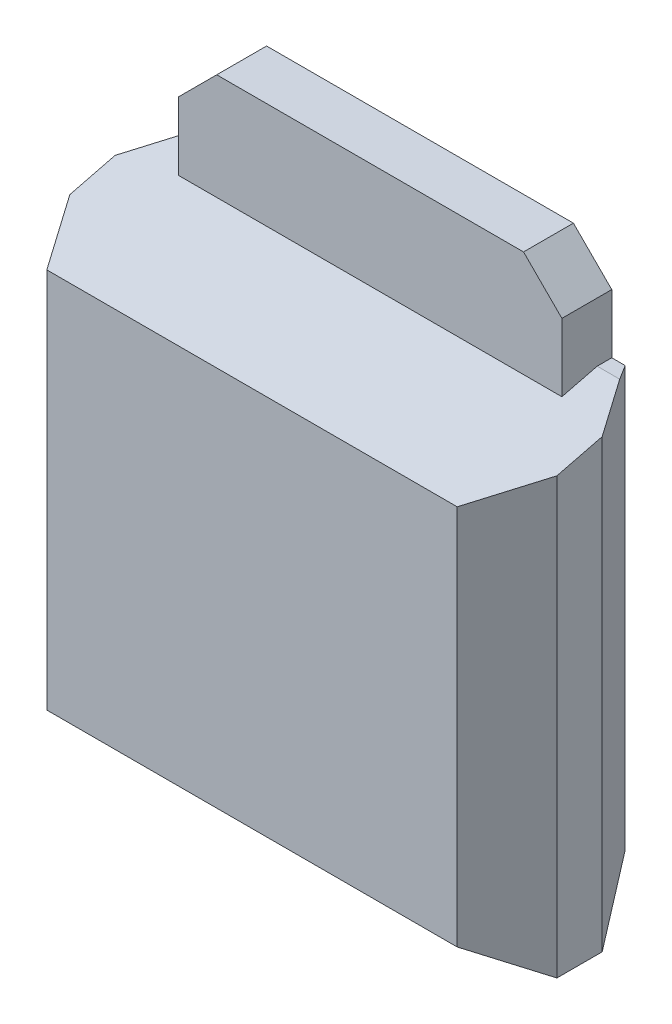
ISO-10303-21;
HEADER;
FILE_DESCRIPTION(('STEP AP214'),'2;1');
FILE_NAME('part.step','',(''),(''),'','','');
FILE_SCHEMA(('AUTOMOTIVE_DESIGN { 1 0 10303 214 1 1 1 1 }'));
ENDSEC;
DATA;
#1=APPLICATION_CONTEXT('core data for automotive mechanical design processes');
#2=APPLICATION_PROTOCOL_DEFINITION('international standard','automotive_design',2000,#1);
#3=PRODUCT_CONTEXT('',#1,'mechanical');
#4=PRODUCT('Part','Part','',(#3));
#5=PRODUCT_RELATED_PRODUCT_CATEGORY('part','',(#4));
#6=PRODUCT_DEFINITION_FORMATION('','',#4);
#7=PRODUCT_DEFINITION_CONTEXT('part definition',#1,'design');
#8=PRODUCT_DEFINITION('design','',#6,#7);
#9=PRODUCT_DEFINITION_SHAPE('','',#8);
#10=(LENGTH_UNIT() NAMED_UNIT(*) SI_UNIT(.MILLI.,.METRE.));
#11=(NAMED_UNIT(*) PLANE_ANGLE_UNIT() SI_UNIT($,.RADIAN.));
#12=(NAMED_UNIT(*) SI_UNIT($,.STERADIAN.) SOLID_ANGLE_UNIT());
#13=UNCERTAINTY_MEASURE_WITH_UNIT(LENGTH_MEASURE(1.E-05),#10,'distance_accuracy_value','');
#14=(GEOMETRIC_REPRESENTATION_CONTEXT(3) GLOBAL_UNCERTAINTY_ASSIGNED_CONTEXT((#13)) GLOBAL_UNIT_ASSIGNED_CONTEXT((#10,
#11,#12)) REPRESENTATION_CONTEXT('',''));
#15=CARTESIAN_POINT('',(0.,0.,0.));
#16=DIRECTION('',(0.,0.,1.));
#17=DIRECTION('',(1.,0.,0.));
#18=AXIS2_PLACEMENT_3D('',#15,#16,#17);
#19=CARTESIAN_POINT('',(0.,5.97,2.19));
#20=DIRECTION('',(0.,-1.,0.));
#21=DIRECTION('',(1.,0.,0.));
#22=AXIS2_PLACEMENT_3D('',#19,#20,#21);
#23=PLANE('',#22);
#24=DIRECTION('',(-1.,0.,0.));
#25=VECTOR('',#24,1.);
#26=CARTESIAN_POINT('',(0.,5.97,0.));
#27=LINE('',#26,#25);
#28=CARTESIAN_POINT('',(5.85,5.97,0.));
#29=VERTEX_POINT('',#28);
#30=CARTESIAN_POINT('',(5.675,5.97,0.));
#31=VERTEX_POINT('',#30);
#32=EDGE_CURVE('E178',#29,#31,#27,.T.);
#33=ORIENTED_EDGE('',*,*,#32,.T.);
#34=DIRECTION('',(0.,0.,1.));
#35=VECTOR('',#34,1.);
#36=CARTESIAN_POINT('',(5.675,5.97,2.19));
#37=LINE('',#36,#35);
#38=CARTESIAN_POINT('',(5.675,5.97,0.189999999999976));
#39=VERTEX_POINT('',#38);
#40=EDGE_CURVE('E175',#31,#39,#37,.T.);
#41=ORIENTED_EDGE('',*,*,#40,.T.);
#42=DIRECTION('',(1.,0.,0.));
#43=VECTOR('',#42,1.);
#44=CARTESIAN_POINT('',(0.,5.97,0.189999999999976));
#45=LINE('',#44,#43);
#46=CARTESIAN_POINT('',(5.96874999999998,5.97,0.189999999999973));
#47=VERTEX_POINT('',#46);
#48=EDGE_CURVE('E241',#39,#47,#45,.T.);
#49=ORIENTED_EDGE('',*,*,#48,.T.);
#50=DIRECTION('',(-0.52999894000318,0.,-0.847998304005088));
#51=VECTOR('',#50,1.);
#52=CARTESIAN_POINT('',(6.35,5.97,0.800000000000004));
#53=LINE('',#52,#51);
#54=EDGE_CURVE('E194',#47,#29,#53,.T.);
#55=ORIENTED_EDGE('',*,*,#54,.T.);
#56=EDGE_LOOP('',(#33,#41,#49,#55));
#57=FACE_BOUND('',#56,.T.);
#58=ADVANCED_FACE('F30',(#57),#23,.F.);
#59=CARTESIAN_POINT('',(0.,0.,2.19));
#60=DIRECTION('',(1.,0.,0.));
#61=DIRECTION('',(0.,0.,-1.));
#62=AXIS2_PLACEMENT_3D('',#59,#60,#61);
#63=PLANE('',#62);
#64=DIRECTION('',(0.,1.,0.));
#65=VECTOR('',#64,1.);
#66=CARTESIAN_POINT('',(0.,0.,1.39));
#67=LINE('',#66,#65);
#68=CARTESIAN_POINT('',(0.,0.,1.39));
#69=VERTEX_POINT('',#68);
#70=CARTESIAN_POINT('',(0.,5.67,1.39));
#71=VERTEX_POINT('',#70);
#72=EDGE_CURVE('E219',#69,#71,#67,.T.);
#73=ORIENTED_EDGE('',*,*,#72,.T.);
#74=DIRECTION('',(0.,-0.24253562503633,0.970142500145333));
#75=VECTOR('',#74,1.);
#76=CARTESIAN_POINT('',(0.,5.47,2.19));
#77=LINE('',#76,#75);
#78=CARTESIAN_POINT('',(0.,5.81749999999999,0.800000000000006));
#79=VERTEX_POINT('',#78);
#80=EDGE_CURVE('E237',#71,#79,#77,.F.);
#81=ORIENTED_EDGE('',*,*,#80,.T.);
#82=DIRECTION('',(0.,-1.,0.));
#83=VECTOR('',#82,1.);
#84=CARTESIAN_POINT('',(0.,0.500000000000002,0.800000000000006));
#85=LINE('',#84,#83);
#86=CARTESIAN_POINT('',(0.,0.,0.800000000000006));
#87=VERTEX_POINT('',#86);
#88=EDGE_CURVE('E222',#79,#87,#85,.T.);
#89=ORIENTED_EDGE('',*,*,#88,.T.);
#90=DIRECTION('',(0.,0.,-1.));
#91=VECTOR('',#90,1.);
#92=CARTESIAN_POINT('',(0.,0.,2.19));
#93=LINE('',#92,#91);
#94=EDGE_CURVE('E183',#69,#87,#93,.T.);
#95=ORIENTED_EDGE('',*,*,#94,.F.);
#96=EDGE_LOOP('',(#73,#81,#89,#95));
#97=FACE_BOUND('',#96,.T.);
#98=ADVANCED_FACE('F295',(#97),#63,.F.);
#99=CARTESIAN_POINT('',(0.,0.,2.19));
#100=DIRECTION('',(0.,1.,0.));
#101=DIRECTION('',(0.,0.,1.));
#102=AXIS2_PLACEMENT_3D('',#99,#100,#101);
#103=PLANE('',#102);
#104=ORIENTED_EDGE('',*,*,#94,.T.);
#105=DIRECTION('',(1.,0.,0.));
#106=VECTOR('',#105,1.);
#107=CARTESIAN_POINT('',(5.85,0.,0.800000000000006));
#108=LINE('',#107,#106);
#109=CARTESIAN_POINT('',(6.35,0.,0.800000000000003));
#110=VERTEX_POINT('',#109);
#111=EDGE_CURVE('E207',#87,#110,#108,.T.);
#112=ORIENTED_EDGE('',*,*,#111,.T.);
#113=DIRECTION('',(0.,0.,-1.));
#114=VECTOR('',#113,1.);
#115=CARTESIAN_POINT('',(6.35,0.,2.19));
#116=LINE('',#115,#114);
#117=CARTESIAN_POINT('',(6.35,0.,1.39));
#118=VERTEX_POINT('',#117);
#119=EDGE_CURVE('E180',#118,#110,#116,.T.);
#120=ORIENTED_EDGE('',*,*,#119,.F.);
#121=DIRECTION('',(-1.,0.,0.));
#122=VECTOR('',#121,1.);
#123=CARTESIAN_POINT('',(0.,0.,1.39));
#124=LINE('',#123,#122);
#125=EDGE_CURVE('E204',#118,#69,#124,.T.);
#126=ORIENTED_EDGE('',*,*,#125,.T.);
#127=EDGE_LOOP('',(#104,#112,#120,#126));
#128=FACE_BOUND('',#127,.T.);
#129=ADVANCED_FACE('F327',(#128),#103,.F.);
#130=CARTESIAN_POINT('',(6.35,0.,2.19));
#131=DIRECTION('',(-1.,0.,0.));
#132=DIRECTION('',(0.,0.,1.));
#133=AXIS2_PLACEMENT_3D('',#130,#131,#132);
#134=PLANE('',#133);
#135=DIRECTION('',(0.,1.,0.));
#136=VECTOR('',#135,1.);
#137=CARTESIAN_POINT('',(6.35,5.97,0.800000000000003));
#138=LINE('',#137,#136);
#139=CARTESIAN_POINT('',(6.35,5.81749999999999,0.800000000000003));
#140=VERTEX_POINT('',#139);
#141=EDGE_CURVE('E191',#110,#140,#138,.T.);
#142=ORIENTED_EDGE('',*,*,#141,.T.);
#143=DIRECTION('',(0.,0.24253562503633,-0.970142500145333));
#144=VECTOR('',#143,1.);
#145=CARTESIAN_POINT('',(6.35,5.47,2.19));
#146=LINE('',#145,#144);
#147=CARTESIAN_POINT('',(6.35,5.67,1.39));
#148=VERTEX_POINT('',#147);
#149=EDGE_CURVE('E246',#140,#148,#146,.F.);
#150=ORIENTED_EDGE('',*,*,#149,.T.);
#151=DIRECTION('',(0.,-1.,0.));
#152=VECTOR('',#151,1.);
#153=CARTESIAN_POINT('',(6.35,0.,1.39));
#154=LINE('',#153,#152);
#155=EDGE_CURVE('E189',#148,#118,#154,.T.);
#156=ORIENTED_EDGE('',*,*,#155,.T.);
#157=ORIENTED_EDGE('',*,*,#119,.T.);
#158=EDGE_LOOP('',(#142,#150,#156,#157));
#159=FACE_BOUND('',#158,.T.);
#160=ADVANCED_FACE('F315',(#159),#134,.F.);
#161=CARTESIAN_POINT('',(0.381250000000018,5.97,0.189999999999976));
#162=VERTEX_POINT('',#161);
#163=CARTESIAN_POINT('',(0.675,5.97,0.189999999999976));
#164=VERTEX_POINT('',#163);
#165=EDGE_CURVE('E242',#162,#164,#45,.T.);
#166=ORIENTED_EDGE('',*,*,#165,.T.);
#167=DIRECTION('',(0.,0.,-1.));
#168=VECTOR('',#167,1.);
#169=CARTESIAN_POINT('',(0.675,5.97,2.19));
#170=LINE('',#169,#168);
#171=CARTESIAN_POINT('',(0.674999999999999,5.97,0.));
#172=VERTEX_POINT('',#171);
#173=EDGE_CURVE('E160',#164,#172,#170,.T.);
#174=ORIENTED_EDGE('',*,*,#173,.T.);
#175=CARTESIAN_POINT('',(0.500000000000002,5.97,0.));
#176=VERTEX_POINT('',#175);
#177=EDGE_CURVE('E177',#172,#176,#27,.T.);
#178=ORIENTED_EDGE('',*,*,#177,.T.);
#179=DIRECTION('',(-0.529998940003179,0.,0.847998304005089));
#180=VECTOR('',#179,1.);
#181=CARTESIAN_POINT('',(0.,5.97,0.800000000000005));
#182=LINE('',#181,#180);
#183=EDGE_CURVE('E229',#176,#162,#182,.T.);
#184=ORIENTED_EDGE('',*,*,#183,.T.);
#185=EDGE_LOOP('',(#166,#174,#178,#184));
#186=FACE_BOUND('',#185,.T.);
#187=ADVANCED_FACE('F286',(#186),#23,.F.);
#188=CARTESIAN_POINT('',(0.,5.97,2.19));
#189=DIRECTION('',(0.,0.,-1.));
#190=DIRECTION('',(-1.,0.,0.));
#191=AXIS2_PLACEMENT_3D('',#188,#189,#190);
#192=PLANE('',#191);
#193=DIRECTION('',(0.,1.,0.));
#194=VECTOR('',#193,1.);
#195=CARTESIAN_POINT('',(5.85,5.97,2.19));
#196=LINE('',#195,#194);
#197=CARTESIAN_POINT('',(5.85,0.5,2.19));
#198=VERTEX_POINT('',#197);
#199=CARTESIAN_POINT('',(5.85,5.47,2.19));
#200=VERTEX_POINT('',#199);
#201=EDGE_CURVE('E186',#198,#200,#196,.T.);
#202=ORIENTED_EDGE('',*,*,#201,.T.);
#203=DIRECTION('',(-1.,0.,0.));
#204=VECTOR('',#203,1.);
#205=CARTESIAN_POINT('',(0.,5.47,2.19));
#206=LINE('',#205,#204);
#207=CARTESIAN_POINT('',(0.5,5.47,2.19));
#208=VERTEX_POINT('',#207);
#209=EDGE_CURVE('E232',#200,#208,#206,.T.);
#210=ORIENTED_EDGE('',*,*,#209,.T.);
#211=DIRECTION('',(0.,-1.,0.));
#212=VECTOR('',#211,1.);
#213=CARTESIAN_POINT('',(0.5,5.97,2.19));
#214=LINE('',#213,#212);
#215=CARTESIAN_POINT('',(0.5,0.5,2.19));
#216=VERTEX_POINT('',#215);
#217=EDGE_CURVE('E215',#208,#216,#214,.T.);
#218=ORIENTED_EDGE('',*,*,#217,.T.);
#219=DIRECTION('',(1.,0.,0.));
#220=VECTOR('',#219,1.);
#221=CARTESIAN_POINT('',(0.,0.5,2.19));
#222=LINE('',#221,#220);
#223=EDGE_CURVE('E199',#216,#198,#222,.T.);
#224=ORIENTED_EDGE('',*,*,#223,.T.);
#225=EDGE_LOOP('',(#202,#210,#218,#224));
#226=FACE_BOUND('',#225,.T.);
#227=ADVANCED_FACE('F305',(#226),#192,.F.);
#228=CARTESIAN_POINT('',(0.,5.97,0.));
#229=DIRECTION('',(0.,0.,-1.));
#230=DIRECTION('',(-1.,0.,0.));
#231=AXIS2_PLACEMENT_3D('',#228,#229,#230);
#232=PLANE('',#231);
#233=DIRECTION('',(-1.,0.,0.));
#234=VECTOR('',#233,1.);
#235=CARTESIAN_POINT('',(0.675,7.24,0.));
#236=LINE('',#235,#234);
#237=CARTESIAN_POINT('',(5.175,7.24,0.));
#238=VERTEX_POINT('',#237);
#239=CARTESIAN_POINT('',(1.175,7.24,0.));
#240=VERTEX_POINT('',#239);
#241=EDGE_CURVE('E270',#238,#240,#236,.T.);
#242=ORIENTED_EDGE('',*,*,#241,.F.);
#243=DIRECTION('',(0.707106781186547,-0.707106781186548,0.));
#244=VECTOR('',#243,1.);
#245=CARTESIAN_POINT('',(3.2225,9.1925,0.));
#246=LINE('',#245,#244);
#247=CARTESIAN_POINT('',(5.675,6.74,0.));
#248=VERTEX_POINT('',#247);
#249=EDGE_CURVE('E258',#238,#248,#246,.T.);
#250=ORIENTED_EDGE('',*,*,#249,.T.);
#251=DIRECTION('',(0.,1.,0.));
#252=VECTOR('',#251,1.);
#253=CARTESIAN_POINT('',(5.675,0.969999999999998,0.));
#254=LINE('',#253,#252);
#255=EDGE_CURVE('E167',#31,#248,#254,.T.);
#256=ORIENTED_EDGE('',*,*,#255,.F.);
#257=ORIENTED_EDGE('',*,*,#32,.F.);
#258=DIRECTION('',(0.,-1.,0.));
#259=VECTOR('',#258,1.);
#260=CARTESIAN_POINT('',(5.85,0.,0.));
#261=LINE('',#260,#259);
#262=CARTESIAN_POINT('',(5.85,0.500000000000002,0.));
#263=VERTEX_POINT('',#262);
#264=EDGE_CURVE('E196',#29,#263,#261,.T.);
#265=ORIENTED_EDGE('',*,*,#264,.T.);
#266=DIRECTION('',(-1.,0.,0.));
#267=VECTOR('',#266,1.);
#268=CARTESIAN_POINT('',(0.,0.500000000000002,0.));
#269=LINE('',#268,#267);
#270=CARTESIAN_POINT('',(0.500000000000002,0.500000000000002,0.));
#271=VERTEX_POINT('',#270);
#272=EDGE_CURVE('E212',#263,#271,#269,.T.);
#273=ORIENTED_EDGE('',*,*,#272,.T.);
#274=DIRECTION('',(0.,1.,0.));
#275=VECTOR('',#274,1.);
#276=CARTESIAN_POINT('',(0.500000000000002,5.97,0.));
#277=LINE('',#276,#275);
#278=EDGE_CURVE('E226',#271,#176,#277,.T.);
#279=ORIENTED_EDGE('',*,*,#278,.T.);
#280=ORIENTED_EDGE('',*,*,#177,.F.);
#281=DIRECTION('',(0.,1.,0.));
#282=VECTOR('',#281,1.);
#283=CARTESIAN_POINT('',(0.674999999999999,0.97,0.));
#284=LINE('',#283,#282);
#285=CARTESIAN_POINT('',(0.675,6.74,0.));
#286=VERTEX_POINT('',#285);
#287=EDGE_CURVE('E165',#172,#286,#284,.T.);
#288=ORIENTED_EDGE('',*,*,#287,.T.);
#289=DIRECTION('',(0.707106781186546,0.707106781186549,0.));
#290=VECTOR('',#289,1.);
#291=CARTESIAN_POINT('',(-0.0474999999999982,6.0175,0.));
#292=LINE('',#291,#290);
#293=EDGE_CURVE('E256',#286,#240,#292,.T.);
#294=ORIENTED_EDGE('',*,*,#293,.T.);
#295=EDGE_LOOP('',(#242,#250,#256,#257,#265,#273,#279,#280,#288,#294));
#296=FACE_BOUND('',#295,.T.);
#297=ADVANCED_FACE('F275',(#296),#232,.T.);
#298=CARTESIAN_POINT('',(5.85,5.97,2.19));
#299=DIRECTION('',(-0.847998304005088,0.,-0.529998940003179));
#300=DIRECTION('',(-0.529998940003179,0.,0.847998304005088));
#301=AXIS2_PLACEMENT_3D('',#298,#299,#300);
#302=PLANE('',#301);
#303=ORIENTED_EDGE('',*,*,#155,.F.);
#304=DIRECTION('',(-0.518475847365212,-0.207390338946082,0.829561355784341));
#305=VECTOR('',#304,1.);
#306=CARTESIAN_POINT('',(5.90376344086021,5.49150537634408,2.10397849462366));
#307=LINE('',#306,#305);
#308=EDGE_CURVE('E161',#148,#200,#307,.T.);
#309=ORIENTED_EDGE('',*,*,#308,.T.);
#310=ORIENTED_EDGE('',*,*,#201,.F.);
#311=DIRECTION('',(0.468292905790847,-0.468292905790846,-0.749268649265356));
#312=VECTOR('',#311,1.);
#313=CARTESIAN_POINT('',(4.65043859649123,1.69956140350877,4.10929824561403));
#314=LINE('',#313,#312);
#315=EDGE_CURVE('E201',#198,#118,#314,.T.);
#316=ORIENTED_EDGE('',*,*,#315,.T.);
#317=EDGE_LOOP('',(#303,#309,#310,#316));
#318=FACE_BOUND('',#317,.T.);
#319=ADVANCED_FACE('F310',(#318),#302,.F.);
#320=CARTESIAN_POINT('',(6.35,0.,0.800000000000003));
#321=DIRECTION('',(0.847998304005088,0.,-0.52999894000318));
#322=DIRECTION('',(-0.52999894000318,0.,-0.847998304005088));
#323=AXIS2_PLACEMENT_3D('',#320,#321,#322);
#324=PLANE('',#323);
#325=ORIENTED_EDGE('',*,*,#54,.F.);
#326=DIRECTION('',(-0.518475847365213,0.207390338946083,-0.829561355784341));
#327=VECTOR('',#326,1.);
#328=CARTESIAN_POINT('',(6.97553763440859,5.56728494623656,1.80086021505375));
#329=LINE('',#328,#327);
#330=EDGE_CURVE('E244',#47,#140,#329,.F.);
#331=ORIENTED_EDGE('',*,*,#330,.T.);
#332=ORIENTED_EDGE('',*,*,#141,.F.);
#333=DIRECTION('',(-0.468292905790847,0.468292905790846,-0.749268649265356));
#334=VECTOR('',#333,1.);
#335=CARTESIAN_POINT('',(6.35,0.,0.800000000000003));
#336=LINE('',#335,#334);
#337=EDGE_CURVE('E210',#110,#263,#336,.T.);
#338=ORIENTED_EDGE('',*,*,#337,.T.);
#339=ORIENTED_EDGE('',*,*,#264,.F.);
#340=EDGE_LOOP('',(#325,#331,#332,#338,#339));
#341=FACE_BOUND('',#340,.T.);
#342=ADVANCED_FACE('F319',(#341),#324,.T.);
#343=CARTESIAN_POINT('',(0.,0.5,2.19));
#344=DIRECTION('',(0.,0.847998304005089,-0.529998940003178));
#345=DIRECTION('',(0.,0.529998940003178,0.847998304005089));
#346=AXIS2_PLACEMENT_3D('',#343,#344,#345);
#347=PLANE('',#346);
#348=ORIENTED_EDGE('',*,*,#223,.F.);
#349=DIRECTION('',(-0.468292905790846,-0.468292905790846,-0.749268649265356));
#350=VECTOR('',#349,1.);
#351=CARTESIAN_POINT('',(0.390350877192983,0.390350877192983,2.01456140350877));
#352=LINE('',#351,#350);
#353=EDGE_CURVE('E217',#216,#69,#352,.T.);
#354=ORIENTED_EDGE('',*,*,#353,.T.);
#355=ORIENTED_EDGE('',*,*,#125,.F.);
#356=ORIENTED_EDGE('',*,*,#315,.F.);
#357=EDGE_LOOP('',(#348,#354,#355,#356));
#358=FACE_BOUND('',#357,.T.);
#359=ADVANCED_FACE('F330',(#358),#347,.F.);
#360=CARTESIAN_POINT('',(0.,0.,0.800000000000006));
#361=DIRECTION('',(0.,-0.847998304005089,-0.529998940003179));
#362=DIRECTION('',(0.,0.529998940003179,-0.847998304005089));
#363=AXIS2_PLACEMENT_3D('',#360,#361,#362);
#364=PLANE('',#363);
#365=ORIENTED_EDGE('',*,*,#111,.F.);
#366=DIRECTION('',(0.468292905790846,0.468292905790846,-0.749268649265356));
#367=VECTOR('',#366,1.);
#368=CARTESIAN_POINT('',(0.,0.,0.800000000000006));
#369=LINE('',#368,#367);
#370=EDGE_CURVE('E224',#87,#271,#369,.T.);
#371=ORIENTED_EDGE('',*,*,#370,.T.);
#372=ORIENTED_EDGE('',*,*,#272,.F.);
#373=ORIENTED_EDGE('',*,*,#337,.F.);
#374=EDGE_LOOP('',(#365,#371,#372,#373));
#375=FACE_BOUND('',#374,.T.);
#376=ADVANCED_FACE('F325',(#375),#364,.T.);
#377=CARTESIAN_POINT('',(0.5,5.97,2.19));
#378=DIRECTION('',(0.847998304005089,0.,-0.529998940003178));
#379=DIRECTION('',(-0.529998940003178,0.,-0.847998304005089));
#380=AXIS2_PLACEMENT_3D('',#377,#378,#379);
#381=PLANE('',#380);
#382=ORIENTED_EDGE('',*,*,#217,.F.);
#383=DIRECTION('',(-0.518475847365211,0.207390338946083,-0.829561355784342));
#384=VECTOR('',#383,1.);
#385=CARTESIAN_POINT('',(0.446236559139786,5.49150537634409,2.10397849462366));
#386=LINE('',#385,#384);
#387=EDGE_CURVE('E235',#208,#71,#386,.T.);
#388=ORIENTED_EDGE('',*,*,#387,.T.);
#389=ORIENTED_EDGE('',*,*,#72,.F.);
#390=ORIENTED_EDGE('',*,*,#353,.F.);
#391=EDGE_LOOP('',(#382,#388,#389,#390));
#392=FACE_BOUND('',#391,.T.);
#393=ADVANCED_FACE('F300',(#392),#381,.F.);
#394=CARTESIAN_POINT('',(0.,0.,0.800000000000006));
#395=DIRECTION('',(-0.847998304005089,0.,-0.529998940003179));
#396=DIRECTION('',(-0.529998940003179,0.,0.847998304005089));
#397=AXIS2_PLACEMENT_3D('',#394,#395,#396);
#398=PLANE('',#397);
#399=ORIENTED_EDGE('',*,*,#88,.F.);
#400=DIRECTION('',(-0.518475847365212,-0.207390338946082,0.829561355784341));
#401=VECTOR('',#400,1.);
#402=CARTESIAN_POINT('',(-0.625537634408593,5.56728494623656,1.80086021505376));
#403=LINE('',#402,#401);
#404=EDGE_CURVE('E239',#79,#162,#403,.F.);
#405=ORIENTED_EDGE('',*,*,#404,.T.);
#406=ORIENTED_EDGE('',*,*,#183,.F.);
#407=ORIENTED_EDGE('',*,*,#278,.F.);
#408=ORIENTED_EDGE('',*,*,#370,.F.);
#409=EDGE_LOOP('',(#399,#405,#406,#407,#408));
#410=FACE_BOUND('',#409,.T.);
#411=ADVANCED_FACE('F291',(#410),#398,.T.);
#412=CARTESIAN_POINT('',(0.,5.47,2.19));
#413=DIRECTION('',(0.,-0.970142500145333,-0.24253562503633));
#414=DIRECTION('',(0.,0.24253562503633,-0.970142500145333));
#415=AXIS2_PLACEMENT_3D('',#412,#413,#414);
#416=PLANE('',#415);
#417=DIRECTION('',(0.,-0.24253562503633,0.970142500145333));
#418=VECTOR('',#417,1.);
#419=CARTESIAN_POINT('',(5.675,5.47,2.19));
#420=LINE('',#419,#418);
#421=CARTESIAN_POINT('',(5.675,5.85499999999999,0.65));
#422=VERTEX_POINT('',#421);
#423=EDGE_CURVE('E152',#422,#39,#420,.F.);
#424=ORIENTED_EDGE('',*,*,#423,.F.);
#425=DIRECTION('',(-1.,0.,0.));
#426=VECTOR('',#425,1.);
#427=CARTESIAN_POINT('',(0.,5.855,0.65));
#428=LINE('',#427,#426);
#429=CARTESIAN_POINT('',(0.675,5.855,0.65));
#430=VERTEX_POINT('',#429);
#431=EDGE_CURVE('E144',#430,#422,#428,.F.);
#432=ORIENTED_EDGE('',*,*,#431,.F.);
#433=DIRECTION('',(0.,0.24253562503633,-0.970142500145333));
#434=VECTOR('',#433,1.);
#435=CARTESIAN_POINT('',(0.675,5.47,2.19));
#436=LINE('',#435,#434);
#437=EDGE_CURVE('E148',#164,#430,#436,.F.);
#438=ORIENTED_EDGE('',*,*,#437,.F.);
#439=ORIENTED_EDGE('',*,*,#165,.F.);
#440=ORIENTED_EDGE('',*,*,#404,.F.);
#441=ORIENTED_EDGE('',*,*,#80,.F.);
#442=ORIENTED_EDGE('',*,*,#387,.F.);
#443=ORIENTED_EDGE('',*,*,#209,.F.);
#444=ORIENTED_EDGE('',*,*,#308,.F.);
#445=ORIENTED_EDGE('',*,*,#149,.F.);
#446=ORIENTED_EDGE('',*,*,#330,.F.);
#447=ORIENTED_EDGE('',*,*,#48,.F.);
#448=EDGE_LOOP('',(#424,#432,#438,#439,#440,#441,#442,#443,#444,#445,#446,#447));
#449=FACE_BOUND('',#448,.T.);
#450=ADVANCED_FACE('F146',(#449),#416,.F.);
#451=CARTESIAN_POINT('',(5.675,0.969999999999998,0.));
#452=DIRECTION('',(1.,0.,0.));
#453=DIRECTION('',(0.,1.,0.));
#454=AXIS2_PLACEMENT_3D('',#451,#452,#453);
#455=PLANE('',#454);
#456=ORIENTED_EDGE('',*,*,#255,.T.);
#457=DIRECTION('',(0.,0.,1.));
#458=VECTOR('',#457,1.);
#459=CARTESIAN_POINT('',(5.675,6.74,0.65));
#460=LINE('',#459,#458);
#461=CARTESIAN_POINT('',(5.675,6.74,0.65));
#462=VERTEX_POINT('',#461);
#463=EDGE_CURVE('E53',#248,#462,#460,.T.);
#464=ORIENTED_EDGE('',*,*,#463,.T.);
#465=DIRECTION('',(0.,1.,0.));
#466=VECTOR('',#465,1.);
#467=CARTESIAN_POINT('',(5.675,0.969999999999998,0.65));
#468=LINE('',#467,#466);
#469=EDGE_CURVE('E164',#422,#462,#468,.T.);
#470=ORIENTED_EDGE('',*,*,#469,.F.);
#471=ORIENTED_EDGE('',*,*,#423,.T.);
#472=ORIENTED_EDGE('',*,*,#40,.F.);
#473=EDGE_LOOP('',(#456,#464,#470,#471,#472));
#474=FACE_BOUND('',#473,.T.);
#475=ADVANCED_FACE('F278',(#474),#455,.T.);
#476=CARTESIAN_POINT('',(0.674999999999999,0.97,0.));
#477=DIRECTION('',(-1.,0.,0.));
#478=DIRECTION('',(0.,-1.,0.));
#479=AXIS2_PLACEMENT_3D('',#476,#477,#478);
#480=PLANE('',#479);
#481=DIRECTION('',(0.,1.,0.));
#482=VECTOR('',#481,1.);
#483=CARTESIAN_POINT('',(0.674999999999999,0.97,0.65));
#484=LINE('',#483,#482);
#485=CARTESIAN_POINT('',(0.675,6.74,0.65));
#486=VERTEX_POINT('',#485);
#487=EDGE_CURVE('E157',#430,#486,#484,.T.);
#488=ORIENTED_EDGE('',*,*,#487,.T.);
#489=DIRECTION('',(0.,0.,-1.));
#490=VECTOR('',#489,1.);
#491=CARTESIAN_POINT('',(0.675,6.74,0.));
#492=LINE('',#491,#490);
#493=EDGE_CURVE('E11',#486,#286,#492,.T.);
#494=ORIENTED_EDGE('',*,*,#493,.T.);
#495=ORIENTED_EDGE('',*,*,#287,.F.);
#496=ORIENTED_EDGE('',*,*,#173,.F.);
#497=ORIENTED_EDGE('',*,*,#437,.T.);
#498=EDGE_LOOP('',(#488,#494,#495,#496,#497));
#499=FACE_BOUND('',#498,.T.);
#500=ADVANCED_FACE('F156',(#499),#480,.T.);
#501=CARTESIAN_POINT('',(0.674999999999999,0.97,0.65));
#502=DIRECTION('',(0.,0.,1.));
#503=DIRECTION('',(1.,0.,0.));
#504=AXIS2_PLACEMENT_3D('',#501,#502,#503);
#505=PLANE('',#504);
#506=ORIENTED_EDGE('',*,*,#469,.T.);
#507=DIRECTION('',(-0.707106781186547,0.707106781186548,0.));
#508=VECTOR('',#507,1.);
#509=CARTESIAN_POINT('',(6.06,6.35499999999999,0.65));
#510=LINE('',#509,#508);
#511=CARTESIAN_POINT('',(5.175,7.24,0.65));
#512=VERTEX_POINT('',#511);
#513=EDGE_CURVE('E38',#462,#512,#510,.T.);
#514=ORIENTED_EDGE('',*,*,#513,.T.);
#515=DIRECTION('',(1.,0.,0.));
#516=VECTOR('',#515,1.);
#517=CARTESIAN_POINT('',(0.675,7.24,0.65));
#518=LINE('',#517,#516);
#519=CARTESIAN_POINT('',(1.175,7.24,0.65));
#520=VERTEX_POINT('',#519);
#521=EDGE_CURVE('E170',#520,#512,#518,.T.);
#522=ORIENTED_EDGE('',*,*,#521,.F.);
#523=DIRECTION('',(-0.707106781186546,-0.707106781186549,0.));
#524=VECTOR('',#523,1.);
#525=CARTESIAN_POINT('',(-2.21,3.85499999999999,0.65));
#526=LINE('',#525,#524);
#527=EDGE_CURVE('E45',#520,#486,#526,.T.);
#528=ORIENTED_EDGE('',*,*,#527,.T.);
#529=ORIENTED_EDGE('',*,*,#487,.F.);
#530=ORIENTED_EDGE('',*,*,#431,.T.);
#531=EDGE_LOOP('',(#506,#514,#522,#528,#529,#530));
#532=FACE_BOUND('',#531,.T.);
#533=ADVANCED_FACE('F163',(#532),#505,.T.);
#534=CARTESIAN_POINT('',(5.675,7.24,0.));
#535=DIRECTION('',(0.,-1.,0.));
#536=DIRECTION('',(1.,0.,0.));
#537=AXIS2_PLACEMENT_3D('',#534,#535,#536);
#538=PLANE('',#537);
#539=ORIENTED_EDGE('',*,*,#521,.T.);
#540=DIRECTION('',(0.,0.,-1.));
#541=VECTOR('',#540,1.);
#542=CARTESIAN_POINT('',(5.175,7.24,0.));
#543=LINE('',#542,#541);
#544=EDGE_CURVE('E253',#512,#238,#543,.T.);
#545=ORIENTED_EDGE('',*,*,#544,.T.);
#546=ORIENTED_EDGE('',*,*,#241,.T.);
#547=DIRECTION('',(0.,0.,1.));
#548=VECTOR('',#547,1.);
#549=CARTESIAN_POINT('',(1.175,7.24,0.65));
#550=LINE('',#549,#548);
#551=EDGE_CURVE('E250',#240,#520,#550,.T.);
#552=ORIENTED_EDGE('',*,*,#551,.T.);
#553=EDGE_LOOP('',(#539,#545,#546,#552));
#554=FACE_BOUND('',#553,.T.);
#555=ADVANCED_FACE('F266',(#554),#538,.F.);
#556=CARTESIAN_POINT('',(5.175,7.24,0.));
#557=DIRECTION('',(0.707106781186548,0.707106781186547,0.));
#558=DIRECTION('',(-0.707106781186547,0.707106781186548,0.));
#559=AXIS2_PLACEMENT_3D('',#556,#557,#558);
#560=PLANE('',#559);
#561=ORIENTED_EDGE('',*,*,#513,.F.);
#562=ORIENTED_EDGE('',*,*,#463,.F.);
#563=ORIENTED_EDGE('',*,*,#249,.F.);
#564=ORIENTED_EDGE('',*,*,#544,.F.);
#565=EDGE_LOOP('',(#561,#562,#563,#564));
#566=FACE_BOUND('',#565,.T.);
#567=ADVANCED_FACE('F272',(#566),#560,.T.);
#568=CARTESIAN_POINT('',(1.175,7.24,0.));
#569=DIRECTION('',(-0.707106781186549,0.707106781186546,0.));
#570=DIRECTION('',(-0.707106781186546,-0.707106781186549,0.));
#571=AXIS2_PLACEMENT_3D('',#568,#569,#570);
#572=PLANE('',#571);
#573=ORIENTED_EDGE('',*,*,#293,.F.);
#574=ORIENTED_EDGE('',*,*,#493,.F.);
#575=ORIENTED_EDGE('',*,*,#527,.F.);
#576=ORIENTED_EDGE('',*,*,#551,.F.);
#577=EDGE_LOOP('',(#573,#574,#575,#576));
#578=FACE_BOUND('',#577,.T.);
#579=ADVANCED_FACE('F32',(#578),#572,.T.);
#580=CLOSED_SHELL('',(#58,#98,#129,#160,#187,#227,#297,#319,#342,#359,#376,#393,#411,#450,#475,
#500,#533,#555,#567,#579));
#581=MANIFOLD_SOLID_BREP('B2',#580);
#582=ADVANCED_BREP_SHAPE_REPRESENTATION('',(#18,#581),#14);
#583=SHAPE_DEFINITION_REPRESENTATION(#9,#582);
ENDSEC;
END-ISO-10303-21;
